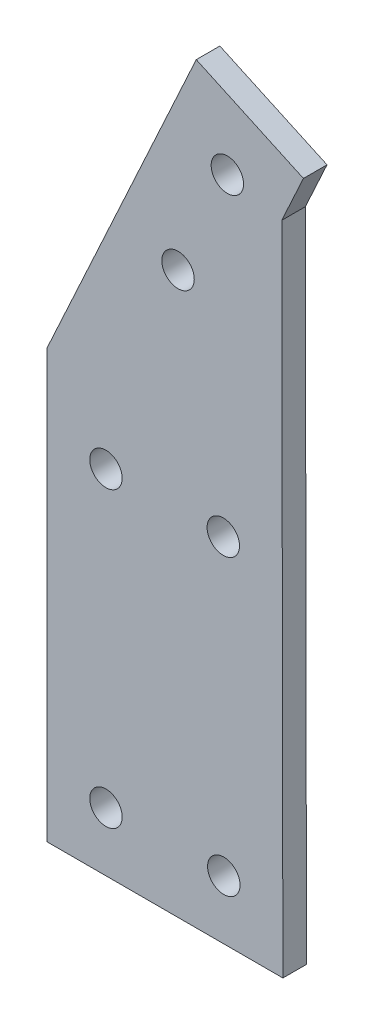
ISO-10303-21;
HEADER;
FILE_DESCRIPTION(('STEP AP214'),'2;1');
FILE_NAME('part.step','',(''),(''),'','','');
FILE_SCHEMA(('AUTOMOTIVE_DESIGN { 1 0 10303 214 1 1 1 1 }'));
ENDSEC;
DATA;
#1=APPLICATION_CONTEXT('core data for automotive mechanical design processes');
#2=APPLICATION_PROTOCOL_DEFINITION('international standard','automotive_design',2000,#1);
#3=PRODUCT_CONTEXT('',#1,'mechanical');
#4=PRODUCT('Part','Part','',(#3));
#5=PRODUCT_RELATED_PRODUCT_CATEGORY('part','',(#4));
#6=PRODUCT_DEFINITION_FORMATION('','',#4);
#7=PRODUCT_DEFINITION_CONTEXT('part definition',#1,'design');
#8=PRODUCT_DEFINITION('design','',#6,#7);
#9=PRODUCT_DEFINITION_SHAPE('','',#8);
#10=(LENGTH_UNIT() NAMED_UNIT(*) SI_UNIT(.MILLI.,.METRE.));
#11=(NAMED_UNIT(*) PLANE_ANGLE_UNIT() SI_UNIT($,.RADIAN.));
#12=(NAMED_UNIT(*) SI_UNIT($,.STERADIAN.) SOLID_ANGLE_UNIT());
#13=UNCERTAINTY_MEASURE_WITH_UNIT(LENGTH_MEASURE(1.E-05),#10,'distance_accuracy_value','');
#14=(GEOMETRIC_REPRESENTATION_CONTEXT(3) GLOBAL_UNCERTAINTY_ASSIGNED_CONTEXT((#13)) GLOBAL_UNIT_ASSIGNED_CONTEXT((#10,
#11,#12)) REPRESENTATION_CONTEXT('',''));
#15=CARTESIAN_POINT('',(0.,0.,0.));
#16=DIRECTION('',(0.,0.,1.));
#17=DIRECTION('',(1.,0.,0.));
#18=AXIS2_PLACEMENT_3D('',#15,#16,#17);
#19=CARTESIAN_POINT('',(-25.311817266447,-55.0055852315926,4.));
#20=DIRECTION('',(0.908432456343395,-0.418031664185747,0.));
#21=DIRECTION('',(0.418031664185747,0.908432456343395,0.));
#22=AXIS2_PLACEMENT_3D('',#19,#20,#21);
#23=PLANE('',#22);
#24=DIRECTION('',(-0.418031664185747,-0.908432456343395,0.));
#25=VECTOR('',#24,1.);
#26=CARTESIAN_POINT('',(-25.311817266447,-55.0055852315926,0.));
#27=LINE('',#26,#25);
#28=CARTESIAN_POINT('',(0.,0.,0.));
#29=VERTEX_POINT('',#28);
#30=CARTESIAN_POINT('',(-25.311817266447,-55.0055852315926,0.));
#31=VERTEX_POINT('',#30);
#32=EDGE_CURVE('E116',#29,#31,#27,.T.);
#33=ORIENTED_EDGE('',*,*,#32,.T.);
#34=DIRECTION('',(0.,0.,-1.));
#35=VECTOR('',#34,1.);
#36=CARTESIAN_POINT('',(-25.311817266447,-55.0055852315926,4.));
#37=LINE('',#36,#35);
#38=CARTESIAN_POINT('',(-25.311817266447,-55.0055852315926,4.));
#39=VERTEX_POINT('',#38);
#40=EDGE_CURVE('E11',#39,#31,#37,.T.);
#41=ORIENTED_EDGE('',*,*,#40,.F.);
#42=DIRECTION('',(-0.418031664185747,-0.908432456343395,0.));
#43=VECTOR('',#42,1.);
#44=CARTESIAN_POINT('',(-25.311817266447,-55.0055852315926,4.));
#45=LINE('',#44,#43);
#46=CARTESIAN_POINT('',(0.,0.,4.));
#47=VERTEX_POINT('',#46);
#48=EDGE_CURVE('E127',#47,#39,#45,.T.);
#49=ORIENTED_EDGE('',*,*,#48,.F.);
#50=DIRECTION('',(0.,0.,-1.));
#51=VECTOR('',#50,1.);
#52=CARTESIAN_POINT('',(0.,0.,4.));
#53=LINE('',#52,#51);
#54=EDGE_CURVE('E112',#47,#29,#53,.T.);
#55=ORIENTED_EDGE('',*,*,#54,.T.);
#56=EDGE_LOOP('',(#33,#41,#49,#55));
#57=FACE_BOUND('',#56,.T.);
#58=ADVANCED_FACE('F32',(#57),#23,.F.);
#59=CARTESIAN_POINT('',(-25.311817266447,-127.505585231593,4.));
#60=DIRECTION('',(1.,0.,0.));
#61=DIRECTION('',(0.,0.,-1.));
#62=AXIS2_PLACEMENT_3D('',#59,#60,#61);
#63=PLANE('',#62);
#64=DIRECTION('',(0.,-1.,0.));
#65=VECTOR('',#64,1.);
#66=CARTESIAN_POINT('',(-25.311817266447,-127.505585231593,0.));
#67=LINE('',#66,#65);
#68=CARTESIAN_POINT('',(-25.311817266447,-127.505585231593,0.));
#69=VERTEX_POINT('',#68);
#70=EDGE_CURVE('E119',#31,#69,#67,.T.);
#71=ORIENTED_EDGE('',*,*,#70,.T.);
#72=DIRECTION('',(0.,0.,-1.));
#73=VECTOR('',#72,1.);
#74=CARTESIAN_POINT('',(-25.311817266447,-127.505585231593,4.));
#75=LINE('',#74,#73);
#76=CARTESIAN_POINT('',(-25.311817266447,-127.505585231593,4.));
#77=VERTEX_POINT('',#76);
#78=EDGE_CURVE('E40',#77,#69,#75,.T.);
#79=ORIENTED_EDGE('',*,*,#78,.F.);
#80=DIRECTION('',(0.,-1.,0.));
#81=VECTOR('',#80,1.);
#82=CARTESIAN_POINT('',(-25.311817266447,-127.505585231593,4.));
#83=LINE('',#82,#81);
#84=EDGE_CURVE('E85',#39,#77,#83,.T.);
#85=ORIENTED_EDGE('',*,*,#84,.F.);
#86=ORIENTED_EDGE('',*,*,#40,.T.);
#87=EDGE_LOOP('',(#71,#79,#85,#86));
#88=FACE_BOUND('',#87,.T.);
#89=ADVANCED_FACE('F152',(#88),#63,.F.);
#90=CARTESIAN_POINT('',(14.688182733553,-127.505585231593,4.));
#91=DIRECTION('',(0.,1.,0.));
#92=DIRECTION('',(0.,0.,1.));
#93=AXIS2_PLACEMENT_3D('',#90,#91,#92);
#94=PLANE('',#93);
#95=DIRECTION('',(1.,0.,0.));
#96=VECTOR('',#95,1.);
#97=CARTESIAN_POINT('',(14.688182733553,-127.505585231593,0.));
#98=LINE('',#97,#96);
#99=CARTESIAN_POINT('',(14.688182733553,-127.505585231593,0.));
#100=VERTEX_POINT('',#99);
#101=EDGE_CURVE('E122',#69,#100,#98,.T.);
#102=ORIENTED_EDGE('',*,*,#101,.T.);
#103=DIRECTION('',(0.,0.,-1.));
#104=VECTOR('',#103,1.);
#105=CARTESIAN_POINT('',(14.688182733553,-127.505585231593,4.));
#106=LINE('',#105,#104);
#107=CARTESIAN_POINT('',(14.688182733553,-127.505585231593,4.));
#108=VERTEX_POINT('',#107);
#109=EDGE_CURVE('E107',#108,#100,#106,.T.);
#110=ORIENTED_EDGE('',*,*,#109,.F.);
#111=DIRECTION('',(1.,0.,0.));
#112=VECTOR('',#111,1.);
#113=CARTESIAN_POINT('',(14.688182733553,-127.505585231593,4.));
#114=LINE('',#113,#112);
#115=EDGE_CURVE('E98',#77,#108,#114,.T.);
#116=ORIENTED_EDGE('',*,*,#115,.F.);
#117=ORIENTED_EDGE('',*,*,#78,.T.);
#118=EDGE_LOOP('',(#102,#110,#116,#117));
#119=FACE_BOUND('',#118,.T.);
#120=ADVANCED_FACE('F133',(#119),#94,.F.);
#121=CARTESIAN_POINT('',(14.4941507986751,-16.3457545749734,4.));
#122=DIRECTION('',(-0.999998476579877,-0.00174551938537147,0.));
#123=DIRECTION('',(0.00174551938537147,-0.999998476579877,0.));
#124=AXIS2_PLACEMENT_3D('',#121,#122,#123);
#125=PLANE('',#124);
#126=DIRECTION('',(-0.00174551938537147,0.999998476579877,0.));
#127=VECTOR('',#126,1.);
#128=CARTESIAN_POINT('',(14.4941507986751,-16.3457545749734,0.));
#129=LINE('',#128,#127);
#130=CARTESIAN_POINT('',(14.4941507986751,-16.3457545749734,0.));
#131=VERTEX_POINT('',#130);
#132=EDGE_CURVE('E106',#100,#131,#129,.T.);
#133=ORIENTED_EDGE('',*,*,#132,.T.);
#134=DIRECTION('',(0.,0.,-1.));
#135=VECTOR('',#134,1.);
#136=CARTESIAN_POINT('',(14.4941507986751,-16.3457545749734,4.));
#137=LINE('',#136,#135);
#138=CARTESIAN_POINT('',(14.4941507986751,-16.3457545749734,4.));
#139=VERTEX_POINT('',#138);
#140=EDGE_CURVE('E103',#139,#131,#137,.T.);
#141=ORIENTED_EDGE('',*,*,#140,.F.);
#142=DIRECTION('',(-0.00174551938537147,0.999998476579877,0.));
#143=VECTOR('',#142,1.);
#144=CARTESIAN_POINT('',(14.4941507986751,-16.3457545749734,4.));
#145=LINE('',#144,#143);
#146=EDGE_CURVE('E92',#108,#139,#145,.T.);
#147=ORIENTED_EDGE('',*,*,#146,.F.);
#148=ORIENTED_EDGE('',*,*,#109,.T.);
#149=EDGE_LOOP('',(#133,#141,#147,#148));
#150=FACE_BOUND('',#149,.T.);
#151=ADVANCED_FACE('F104',(#150),#125,.F.);
#152=CARTESIAN_POINT('',(18.1686491268679,-8.360633283715,4.));
#153=DIRECTION('',(-0.908432456343394,0.41803166418575,0.));
#154=DIRECTION('',(-0.41803166418575,-0.908432456343394,0.));
#155=AXIS2_PLACEMENT_3D('',#152,#153,#154);
#156=PLANE('',#155);
#157=DIRECTION('',(0.41803166418575,0.908432456343394,0.));
#158=VECTOR('',#157,1.);
#159=CARTESIAN_POINT('',(18.1686491268679,-8.360633283715,0.));
#160=LINE('',#159,#158);
#161=CARTESIAN_POINT('',(18.1686491268679,-8.360633283715,0.));
#162=VERTEX_POINT('',#161);
#163=EDGE_CURVE('E71',#131,#162,#160,.T.);
#164=ORIENTED_EDGE('',*,*,#163,.T.);
#165=DIRECTION('',(0.,0.,-1.));
#166=VECTOR('',#165,1.);
#167=CARTESIAN_POINT('',(18.1686491268679,-8.360633283715,4.));
#168=LINE('',#167,#166);
#169=CARTESIAN_POINT('',(18.1686491268679,-8.360633283715,4.));
#170=VERTEX_POINT('',#169);
#171=EDGE_CURVE('E108',#170,#162,#168,.T.);
#172=ORIENTED_EDGE('',*,*,#171,.F.);
#173=DIRECTION('',(0.41803166418575,0.908432456343394,0.));
#174=VECTOR('',#173,1.);
#175=CARTESIAN_POINT('',(18.1686491268679,-8.360633283715,4.));
#176=LINE('',#175,#174);
#177=EDGE_CURVE('E96',#139,#170,#176,.T.);
#178=ORIENTED_EDGE('',*,*,#177,.F.);
#179=ORIENTED_EDGE('',*,*,#140,.T.);
#180=EDGE_LOOP('',(#164,#172,#178,#179));
#181=FACE_BOUND('',#180,.T.);
#182=ADVANCED_FACE('F110',(#181),#156,.F.);
#183=CARTESIAN_POINT('',(0.,0.,4.));
#184=DIRECTION('',(-0.41803166418575,-0.908432456343394,0.));
#185=DIRECTION('',(0.908432456343394,-0.41803166418575,0.));
#186=AXIS2_PLACEMENT_3D('',#183,#184,#185);
#187=PLANE('',#186);
#188=DIRECTION('',(-0.908432456343394,0.41803166418575,0.));
#189=VECTOR('',#188,1.);
#190=CARTESIAN_POINT('',(0.,0.,0.));
#191=LINE('',#190,#189);
#192=EDGE_CURVE('E77',#162,#29,#191,.T.);
#193=ORIENTED_EDGE('',*,*,#192,.T.);
#194=ORIENTED_EDGE('',*,*,#54,.F.);
#195=DIRECTION('',(-0.908432456343394,0.41803166418575,0.));
#196=VECTOR('',#195,1.);
#197=CARTESIAN_POINT('',(0.,0.,4.));
#198=LINE('',#197,#196);
#199=EDGE_CURVE('E48',#170,#47,#198,.T.);
#200=ORIENTED_EDGE('',*,*,#199,.F.);
#201=ORIENTED_EDGE('',*,*,#171,.T.);
#202=EDGE_LOOP('',(#193,#194,#200,#201));
#203=FACE_BOUND('',#202,.T.);
#204=ADVANCED_FACE('F140',(#203),#187,.F.);
#205=CARTESIAN_POINT('',(0.,0.,4.));
#206=DIRECTION('',(0.,0.,-1.));
#207=DIRECTION('',(-1.,0.,0.));
#208=AXIS2_PLACEMENT_3D('',#205,#206,#207);
#209=PLANE('',#208);
#210=CARTESIAN_POINT('',(-3.08882476802024,-32.4281384225562,4.));
#211=DIRECTION('',(0.,0.,1.));
#212=DIRECTION('',(1.,0.,0.));
#213=AXIS2_PLACEMENT_3D('',#210,#211,#212);
#214=CIRCLE('',#213,2.75);
#215=CARTESIAN_POINT('',(-0.338824768020236,-32.4281384225562,4.));
#216=VERTEX_POINT('',#215);
#217=EDGE_CURVE('E258',#216,#216,#214,.T.);
#218=ORIENTED_EDGE('',*,*,#217,.F.);
#219=EDGE_LOOP('',(#218));
#220=FACE_BOUND('',#219,.T.);
#221=CARTESIAN_POINT('',(5.2718085156947,-14.2594892956883,4.));
#222=DIRECTION('',(0.,0.,1.));
#223=DIRECTION('',(1.,0.,0.));
#224=AXIS2_PLACEMENT_3D('',#221,#222,#223);
#225=CIRCLE('',#224,2.75);
#226=CARTESIAN_POINT('',(8.0218085156947,-14.2594892956883,4.));
#227=VERTEX_POINT('',#226);
#228=EDGE_CURVE('E260',#227,#227,#225,.T.);
#229=ORIENTED_EDGE('',*,*,#228,.F.);
#230=EDGE_LOOP('',(#229));
#231=FACE_BOUND('',#230,.T.);
#232=CARTESIAN_POINT('',(4.58387255716762,-67.7555852315926,4.));
#233=DIRECTION('',(0.,0.,1.));
#234=DIRECTION('',(1.,0.,0.));
#235=AXIS2_PLACEMENT_3D('',#232,#233,#234);
#236=CIRCLE('',#235,2.75);
#237=CARTESIAN_POINT('',(7.33387255716762,-67.7555852315926,4.));
#238=VERTEX_POINT('',#237);
#239=EDGE_CURVE('E266',#238,#238,#236,.T.);
#240=ORIENTED_EDGE('',*,*,#239,.F.);
#241=EDGE_LOOP('',(#240));
#242=FACE_BOUND('',#241,.T.);
#243=CARTESIAN_POINT('',(-15.311817266447,-67.7555852315926,4.));
#244=DIRECTION('',(0.,0.,1.));
#245=DIRECTION('',(1.,0.,0.));
#246=AXIS2_PLACEMENT_3D('',#243,#244,#245);
#247=CIRCLE('',#246,2.75);
#248=CARTESIAN_POINT('',(-12.561817266447,-67.7555852315926,4.));
#249=VERTEX_POINT('',#248);
#250=EDGE_CURVE('E272',#249,#249,#247,.T.);
#251=ORIENTED_EDGE('',*,*,#250,.F.);
#252=EDGE_LOOP('',(#251));
#253=FACE_BOUND('',#252,.T.);
#254=CARTESIAN_POINT('',(4.67071227888323,-117.505585231593,4.));
#255=DIRECTION('',(0.,0.,1.));
#256=DIRECTION('',(1.,0.,0.));
#257=AXIS2_PLACEMENT_3D('',#254,#255,#256);
#258=CIRCLE('',#257,2.75);
#259=CARTESIAN_POINT('',(7.42071227888324,-117.505585231593,4.));
#260=VERTEX_POINT('',#259);
#261=EDGE_CURVE('E278',#260,#260,#258,.T.);
#262=ORIENTED_EDGE('',*,*,#261,.F.);
#263=EDGE_LOOP('',(#262));
#264=FACE_BOUND('',#263,.T.);
#265=CARTESIAN_POINT('',(-15.311817266447,-117.505585231593,4.));
#266=DIRECTION('',(0.,0.,1.));
#267=DIRECTION('',(1.,0.,0.));
#268=AXIS2_PLACEMENT_3D('',#265,#266,#267);
#269=CIRCLE('',#268,2.75);
#270=CARTESIAN_POINT('',(-12.561817266447,-117.505585231593,4.));
#271=VERTEX_POINT('',#270);
#272=EDGE_CURVE('E284',#271,#271,#269,.T.);
#273=ORIENTED_EDGE('',*,*,#272,.F.);
#274=EDGE_LOOP('',(#273));
#275=FACE_BOUND('',#274,.T.);
#276=ORIENTED_EDGE('',*,*,#48,.T.);
#277=ORIENTED_EDGE('',*,*,#84,.T.);
#278=ORIENTED_EDGE('',*,*,#115,.T.);
#279=ORIENTED_EDGE('',*,*,#146,.T.);
#280=ORIENTED_EDGE('',*,*,#177,.T.);
#281=ORIENTED_EDGE('',*,*,#199,.T.);
#282=EDGE_LOOP('',(#276,#277,#278,#279,#280,#281));
#283=FACE_BOUND('',#282,.T.);
#284=ADVANCED_FACE('F94',(#220,#231,#242,#253,#264,#275,#283),#209,.F.);
#285=CARTESIAN_POINT('',(0.,0.,0.));
#286=DIRECTION('',(0.,0.,-1.));
#287=DIRECTION('',(-1.,0.,0.));
#288=AXIS2_PLACEMENT_3D('',#285,#286,#287);
#289=PLANE('',#288);
#290=CARTESIAN_POINT('',(-3.08882476802024,-32.4281384225562,0.));
#291=DIRECTION('',(0.,0.,1.));
#292=DIRECTION('',(1.,0.,0.));
#293=AXIS2_PLACEMENT_3D('',#290,#291,#292);
#294=CIRCLE('',#293,2.75);
#295=CARTESIAN_POINT('',(-0.338824768020236,-32.4281384225562,0.));
#296=VERTEX_POINT('',#295);
#297=EDGE_CURVE('E255',#296,#296,#294,.T.);
#298=ORIENTED_EDGE('',*,*,#297,.T.);
#299=EDGE_LOOP('',(#298));
#300=FACE_BOUND('',#299,.T.);
#301=CARTESIAN_POINT('',(5.2718085156947,-14.2594892956883,0.));
#302=DIRECTION('',(0.,0.,1.));
#303=DIRECTION('',(1.,0.,0.));
#304=AXIS2_PLACEMENT_3D('',#301,#302,#303);
#305=CIRCLE('',#304,2.75);
#306=CARTESIAN_POINT('',(8.0218085156947,-14.2594892956883,0.));
#307=VERTEX_POINT('',#306);
#308=EDGE_CURVE('E263',#307,#307,#305,.T.);
#309=ORIENTED_EDGE('',*,*,#308,.T.);
#310=EDGE_LOOP('',(#309));
#311=FACE_BOUND('',#310,.T.);
#312=CARTESIAN_POINT('',(4.58387255716762,-67.7555852315926,0.));
#313=DIRECTION('',(0.,0.,1.));
#314=DIRECTION('',(1.,0.,0.));
#315=AXIS2_PLACEMENT_3D('',#312,#313,#314);
#316=CIRCLE('',#315,2.75);
#317=CARTESIAN_POINT('',(7.33387255716762,-67.7555852315926,0.));
#318=VERTEX_POINT('',#317);
#319=EDGE_CURVE('E269',#318,#318,#316,.T.);
#320=ORIENTED_EDGE('',*,*,#319,.T.);
#321=EDGE_LOOP('',(#320));
#322=FACE_BOUND('',#321,.T.);
#323=CARTESIAN_POINT('',(-15.311817266447,-67.7555852315926,0.));
#324=DIRECTION('',(0.,0.,1.));
#325=DIRECTION('',(1.,0.,0.));
#326=AXIS2_PLACEMENT_3D('',#323,#324,#325);
#327=CIRCLE('',#326,2.75);
#328=CARTESIAN_POINT('',(-12.561817266447,-67.7555852315926,0.));
#329=VERTEX_POINT('',#328);
#330=EDGE_CURVE('E275',#329,#329,#327,.T.);
#331=ORIENTED_EDGE('',*,*,#330,.T.);
#332=EDGE_LOOP('',(#331));
#333=FACE_BOUND('',#332,.T.);
#334=CARTESIAN_POINT('',(4.67071227888323,-117.505585231593,0.));
#335=DIRECTION('',(0.,0.,1.));
#336=DIRECTION('',(1.,0.,0.));
#337=AXIS2_PLACEMENT_3D('',#334,#335,#336);
#338=CIRCLE('',#337,2.75);
#339=CARTESIAN_POINT('',(7.42071227888324,-117.505585231593,0.));
#340=VERTEX_POINT('',#339);
#341=EDGE_CURVE('E281',#340,#340,#338,.T.);
#342=ORIENTED_EDGE('',*,*,#341,.T.);
#343=EDGE_LOOP('',(#342));
#344=FACE_BOUND('',#343,.T.);
#345=CARTESIAN_POINT('',(-15.311817266447,-117.505585231593,0.));
#346=DIRECTION('',(0.,0.,1.));
#347=DIRECTION('',(1.,0.,0.));
#348=AXIS2_PLACEMENT_3D('',#345,#346,#347);
#349=CIRCLE('',#348,2.75);
#350=CARTESIAN_POINT('',(-12.561817266447,-117.505585231593,0.));
#351=VERTEX_POINT('',#350);
#352=EDGE_CURVE('E120',#351,#351,#349,.T.);
#353=ORIENTED_EDGE('',*,*,#352,.T.);
#354=EDGE_LOOP('',(#353));
#355=FACE_BOUND('',#354,.T.);
#356=ORIENTED_EDGE('',*,*,#32,.F.);
#357=ORIENTED_EDGE('',*,*,#192,.F.);
#358=ORIENTED_EDGE('',*,*,#163,.F.);
#359=ORIENTED_EDGE('',*,*,#132,.F.);
#360=ORIENTED_EDGE('',*,*,#101,.F.);
#361=ORIENTED_EDGE('',*,*,#70,.F.);
#362=EDGE_LOOP('',(#356,#357,#358,#359,#360,#361));
#363=FACE_BOUND('',#362,.T.);
#364=ADVANCED_FACE('F136',(#300,#311,#322,#333,#344,#355,#363),#289,.T.);
#365=CARTESIAN_POINT('',(-15.311817266447,-117.505585231593,0.));
#366=DIRECTION('',(0.,0.,1.));
#367=DIRECTION('',(1.,0.,0.));
#368=AXIS2_PLACEMENT_3D('',#365,#366,#367);
#369=CYLINDRICAL_SURFACE('',#368,2.75);
#370=ORIENTED_EDGE('',*,*,#352,.F.);
#371=EDGE_LOOP('',(#370));
#372=FACE_BOUND('',#371,.T.);
#373=ORIENTED_EDGE('',*,*,#272,.T.);
#374=EDGE_LOOP('',(#373));
#375=FACE_BOUND('',#374,.T.);
#376=ADVANCED_FACE('F180',(#372,#375),#369,.F.);
#377=CARTESIAN_POINT('',(4.67071227888323,-117.505585231593,0.));
#378=DIRECTION('',(0.,0.,1.));
#379=DIRECTION('',(1.,0.,0.));
#380=AXIS2_PLACEMENT_3D('',#377,#378,#379);
#381=CYLINDRICAL_SURFACE('',#380,2.75);
#382=ORIENTED_EDGE('',*,*,#341,.F.);
#383=EDGE_LOOP('',(#382));
#384=FACE_BOUND('',#383,.T.);
#385=ORIENTED_EDGE('',*,*,#261,.T.);
#386=EDGE_LOOP('',(#385));
#387=FACE_BOUND('',#386,.T.);
#388=ADVANCED_FACE('F185',(#384,#387),#381,.F.);
#389=CARTESIAN_POINT('',(-15.311817266447,-67.7555852315926,0.));
#390=DIRECTION('',(0.,0.,1.));
#391=DIRECTION('',(1.,0.,0.));
#392=AXIS2_PLACEMENT_3D('',#389,#390,#391);
#393=CYLINDRICAL_SURFACE('',#392,2.75);
#394=ORIENTED_EDGE('',*,*,#330,.F.);
#395=EDGE_LOOP('',(#394));
#396=FACE_BOUND('',#395,.T.);
#397=ORIENTED_EDGE('',*,*,#250,.T.);
#398=EDGE_LOOP('',(#397));
#399=FACE_BOUND('',#398,.T.);
#400=ADVANCED_FACE('F197',(#396,#399),#393,.F.);
#401=CARTESIAN_POINT('',(4.58387255716762,-67.7555852315926,0.));
#402=DIRECTION('',(0.,0.,1.));
#403=DIRECTION('',(1.,0.,0.));
#404=AXIS2_PLACEMENT_3D('',#401,#402,#403);
#405=CYLINDRICAL_SURFACE('',#404,2.75);
#406=ORIENTED_EDGE('',*,*,#319,.F.);
#407=EDGE_LOOP('',(#406));
#408=FACE_BOUND('',#407,.T.);
#409=ORIENTED_EDGE('',*,*,#239,.T.);
#410=EDGE_LOOP('',(#409));
#411=FACE_BOUND('',#410,.T.);
#412=ADVANCED_FACE('F207',(#408,#411),#405,.F.);
#413=CARTESIAN_POINT('',(5.2718085156947,-14.2594892956883,0.));
#414=DIRECTION('',(0.,0.,1.));
#415=DIRECTION('',(1.,0.,0.));
#416=AXIS2_PLACEMENT_3D('',#413,#414,#415);
#417=CYLINDRICAL_SURFACE('',#416,2.75);
#418=ORIENTED_EDGE('',*,*,#308,.F.);
#419=EDGE_LOOP('',(#418));
#420=FACE_BOUND('',#419,.T.);
#421=ORIENTED_EDGE('',*,*,#228,.T.);
#422=EDGE_LOOP('',(#421));
#423=FACE_BOUND('',#422,.T.);
#424=ADVANCED_FACE('F217',(#420,#423),#417,.F.);
#425=CARTESIAN_POINT('',(-3.08882476802024,-32.4281384225562,0.));
#426=DIRECTION('',(0.,0.,1.));
#427=DIRECTION('',(1.,0.,0.));
#428=AXIS2_PLACEMENT_3D('',#425,#426,#427);
#429=CYLINDRICAL_SURFACE('',#428,2.75);
#430=ORIENTED_EDGE('',*,*,#297,.F.);
#431=EDGE_LOOP('',(#430));
#432=FACE_BOUND('',#431,.T.);
#433=ORIENTED_EDGE('',*,*,#217,.T.);
#434=EDGE_LOOP('',(#433));
#435=FACE_BOUND('',#434,.T.);
#436=ADVANCED_FACE('F238',(#432,#435),#429,.F.);
#437=CLOSED_SHELL('',(#58,#89,#120,#151,#182,#204,#284,#364,#376,#388,#400,#412,#424,#436));
#438=MANIFOLD_SOLID_BREP('B2',#437);
#439=ADVANCED_BREP_SHAPE_REPRESENTATION('',(#18,#438),#14);
#440=SHAPE_DEFINITION_REPRESENTATION(#9,#439);
ENDSEC;
END-ISO-10303-21;
